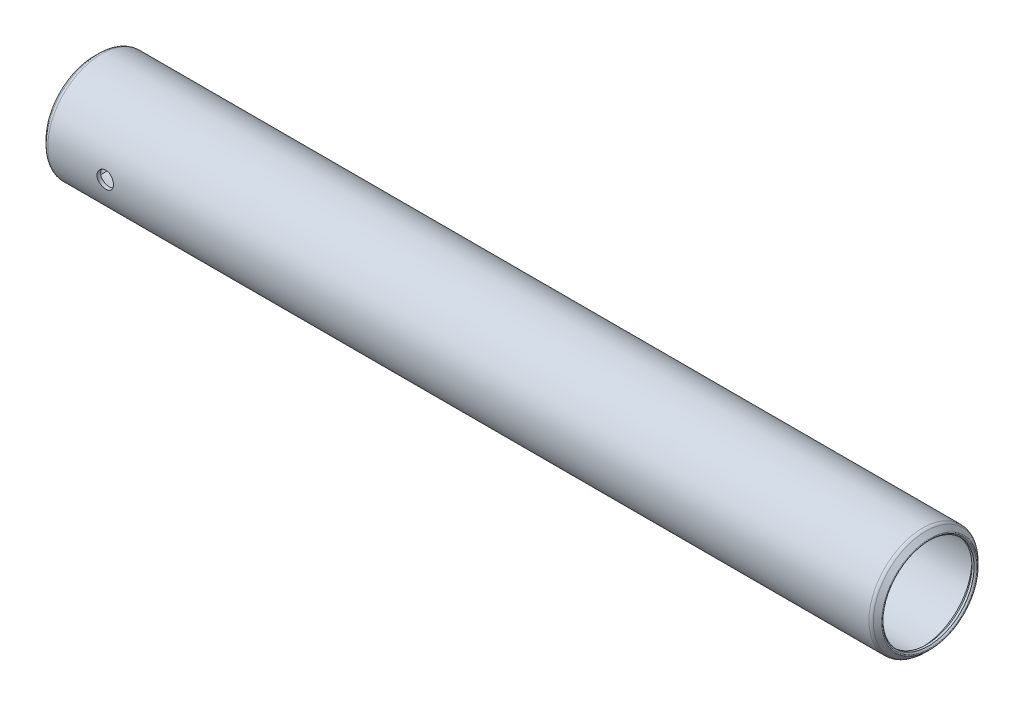
ISO-10303-21;
HEADER;
FILE_DESCRIPTION(('STEP AP214'),'2;1');
FILE_NAME('part.step','',(''),(''),'','','');
FILE_SCHEMA(('AUTOMOTIVE_DESIGN { 1 0 10303 214 1 1 1 1 }'));
ENDSEC;
DATA;
#1=APPLICATION_CONTEXT('core data for automotive mechanical design processes');
#2=APPLICATION_PROTOCOL_DEFINITION('international standard','automotive_design',2000,#1);
#3=PRODUCT_CONTEXT('',#1,'mechanical');
#4=PRODUCT('Part','Part','',(#3));
#5=PRODUCT_RELATED_PRODUCT_CATEGORY('part','',(#4));
#6=PRODUCT_DEFINITION_FORMATION('','',#4);
#7=PRODUCT_DEFINITION_CONTEXT('part definition',#1,'design');
#8=PRODUCT_DEFINITION('design','',#6,#7);
#9=PRODUCT_DEFINITION_SHAPE('','',#8);
#10=(LENGTH_UNIT() NAMED_UNIT(*) SI_UNIT(.MILLI.,.METRE.));
#11=(NAMED_UNIT(*) PLANE_ANGLE_UNIT() SI_UNIT($,.RADIAN.));
#12=(NAMED_UNIT(*) SI_UNIT($,.STERADIAN.) SOLID_ANGLE_UNIT());
#13=UNCERTAINTY_MEASURE_WITH_UNIT(LENGTH_MEASURE(1.E-05),#10,'distance_accuracy_value','');
#14=(GEOMETRIC_REPRESENTATION_CONTEXT(3) GLOBAL_UNCERTAINTY_ASSIGNED_CONTEXT((#13)) GLOBAL_UNIT_ASSIGNED_CONTEXT((#10,
#11,#12)) REPRESENTATION_CONTEXT('',''));
#15=CARTESIAN_POINT('',(0.,0.,0.));
#16=DIRECTION('',(0.,0.,1.));
#17=DIRECTION('',(1.,0.,0.));
#18=AXIS2_PLACEMENT_3D('',#15,#16,#17);
#19=CARTESIAN_POINT('',(120.5484,0.,0.));
#20=DIRECTION('',(-1.,0.,0.));
#21=DIRECTION('',(0.,0.,1.));
#22=AXIS2_PLACEMENT_3D('',#19,#20,#21);
#23=CYLINDRICAL_SURFACE('',#22,7.27075);
#24=CARTESIAN_POINT('',(0.634999999999997,0.,0.));
#25=DIRECTION('',(-1.,0.,0.));
#26=DIRECTION('',(0.,0.,1.));
#27=AXIS2_PLACEMENT_3D('',#24,#25,#26);
#28=CIRCLE('',#27,7.27075);
#29=CARTESIAN_POINT('',(0.634999999999997,0.,7.27075));
#30=VERTEX_POINT('',#29);
#31=EDGE_CURVE('E56',#30,#30,#28,.T.);
#32=ORIENTED_EDGE('',*,*,#31,.T.);
#33=EDGE_LOOP('',(#32));
#34=FACE_BOUND('',#33,.T.);
#35=CARTESIAN_POINT('',(119.9134,0.,0.));
#36=DIRECTION('',(-1.,0.,0.));
#37=DIRECTION('',(0.,0.,1.));
#38=AXIS2_PLACEMENT_3D('',#35,#36,#37);
#39=CIRCLE('',#38,7.27075);
#40=CARTESIAN_POINT('',(119.9134,0.,7.27075));
#41=VERTEX_POINT('',#40);
#42=EDGE_CURVE('E59',#41,#41,#39,.T.);
#43=ORIENTED_EDGE('',*,*,#42,.F.);
#44=EDGE_LOOP('',(#43));
#45=FACE_BOUND('',#44,.T.);
#46=CARTESIAN_POINT('',(10.0838,0.,7.27075));
#47=CARTESIAN_POINT('',(10.0837973180497,-0.0665763656223157,7.27074886912623));
#48=CARTESIAN_POINT('',(10.0782118981357,-0.133189422139325,7.26982603229932));
#49=CARTESIAN_POINT('',(10.0560265204291,-0.264548230355835,7.26623351045891));
#50=CARTESIAN_POINT('',(10.0394163416924,-0.329292191059068,7.26356220448896));
#51=CARTESIAN_POINT('',(9.99569566198161,-0.454993226185556,7.25677245539045));
#52=CARTESIAN_POINT('',(9.96859364975716,-0.51595331592106,7.25265518241654));
#53=CARTESIAN_POINT('',(9.90468063110019,-0.632452772924966,7.24342655383445));
#54=CARTESIAN_POINT('',(9.86787077172315,-0.687992779555633,7.23831531568951));
#55=CARTESIAN_POINT('',(9.78522309678459,-0.792599473441389,7.22761255264284));
#56=CARTESIAN_POINT('',(9.73931276800991,-0.8416085031718,7.22201738797767));
#57=CARTESIAN_POINT('',(9.63992345556096,-0.931264098359722,7.21100533744942));
#58=CARTESIAN_POINT('',(9.5864440012438,-0.971910143426821,7.20558846269812));
#59=CARTESIAN_POINT('',(9.47303978470973,-1.04391602816968,7.19551105091629));
#60=CARTESIAN_POINT('',(9.4130784863992,-1.07521904168257,7.19085521714684));
#61=CARTESIAN_POINT('',(9.28865966029078,-1.12728692857892,7.18287741243743));
#62=CARTESIAN_POINT('',(9.22420242734068,-1.14805249228092,7.17955535412351));
#63=CARTESIAN_POINT('',(9.09323189607469,-1.17827475743791,7.17465739869155));
#64=CARTESIAN_POINT('',(9.02674212310514,-1.18783087478537,7.17306616036318));
#65=CARTESIAN_POINT('',(8.89308526182397,-1.19567118363748,7.1717635771999));
#66=CARTESIAN_POINT('',(8.82591822035366,-1.19395614941143,7.17205210323496));
#67=CARTESIAN_POINT('',(8.69352198271034,-1.17938385727069,7.17446243892077));
#68=CARTESIAN_POINT('',(8.62828012811038,-1.16663813068547,7.17656589715222));
#69=CARTESIAN_POINT('',(8.50087366450289,-1.13054122111993,7.18234037327412));
#70=CARTESIAN_POINT('',(8.43870915827104,-1.10718968419689,7.1860114434795));
#71=CARTESIAN_POINT('',(8.31888728068215,-1.05043049008399,7.19452739942117));
#72=CARTESIAN_POINT('',(8.26125231558848,-1.01697637582203,7.19937768730761));
#73=CARTESIAN_POINT('',(8.15237176299115,-0.940994666220349,7.20970179927714));
#74=CARTESIAN_POINT('',(8.10112667680563,-0.898466359673361,7.21517567221921));
#75=CARTESIAN_POINT('',(8.00583482220782,-0.804935108121529,7.22621089146952));
#76=CARTESIAN_POINT('',(7.9618819845089,-0.753836439796722,7.23177249832445));
#77=CARTESIAN_POINT('',(7.88316045636778,-0.644939097733325,7.24229566674746));
#78=CARTESIAN_POINT('',(7.84839182191106,-0.587140383155392,7.24725722465764));
#79=CARTESIAN_POINT('',(7.78901768412653,-0.466396392315688,7.25602800690079));
#80=CARTESIAN_POINT('',(7.76442031582416,-0.403447044565726,7.25983630820479));
#81=CARTESIAN_POINT('',(7.72617325530038,-0.274234269595054,7.26586402905181));
#82=CARTESIAN_POINT('',(7.71252267456644,-0.207971111808632,7.26808357754679));
#83=CARTESIAN_POINT('',(7.69668363687801,-0.0748214486822753,7.27066641036234));
#84=CARTESIAN_POINT('',(7.69436620334303,-0.00795067683835797,7.27105058098478));
#85=CARTESIAN_POINT('',(7.7009156211892,0.125223792320965,7.26997652394854));
#86=CARTESIAN_POINT('',(7.70978205534316,0.191527510698058,7.2685183650201));
#87=CARTESIAN_POINT('',(7.73834025080113,0.321288563764816,7.26393641843455));
#88=CARTESIAN_POINT('',(7.75796831562904,0.384760293010014,7.26082243459669));
#89=CARTESIAN_POINT('',(7.80742481444332,0.507512183164864,7.25327664455669));
#90=CARTESIAN_POINT('',(7.8372538071436,0.566792114271337,7.24884476617403));
#91=CARTESIAN_POINT('',(7.90656193459883,0.680038969103148,7.23910314951883));
#92=CARTESIAN_POINT('',(7.94612182885248,0.73395583434289,7.23378619167638));
#93=CARTESIAN_POINT('',(8.03365749864083,0.834431646594976,7.22288641864574));
#94=CARTESIAN_POINT('',(8.0816338663578,0.880990075429964,7.21730358477068));
#95=CARTESIAN_POINT('',(8.1852184168714,0.965904124062182,7.20643394566787));
#96=CARTESIAN_POINT('',(8.24089837915758,1.00417270523438,7.20115067484654));
#97=CARTESIAN_POINT('',(8.3579721887638,1.07081332476845,7.19154383416012));
#98=CARTESIAN_POINT('',(8.41936585880266,1.09918567005467,7.18722023453304));
#99=CARTESIAN_POINT('',(8.54587847689332,1.14509752192922,7.18004864937368));
#100=CARTESIAN_POINT('',(8.61098121151069,1.16268073492793,7.1771947179269));
#101=CARTESIAN_POINT('',(8.74326673649393,1.18665298984634,7.17327054668051));
#102=CARTESIAN_POINT('',(8.81044935138015,1.19304297353448,7.17220015681885));
#103=CARTESIAN_POINT('',(8.94411868459628,1.19442171212747,7.17197059783136));
#104=CARTESIAN_POINT('',(9.01060399046328,1.18954744526785,7.17278846653603));
#105=CARTESIAN_POINT('',(9.14179495108415,1.16883182625237,7.17619301197557));
#106=CARTESIAN_POINT('',(9.2065006111217,1.1529905066609,7.17877968345834));
#107=CARTESIAN_POINT('',(9.33224486958994,1.11084231835238,7.1854217631554));
#108=CARTESIAN_POINT('',(9.39328739677579,1.08454690132198,7.18947556380448));
#109=CARTESIAN_POINT('',(9.51011662462723,1.02225094487892,7.19859675637365));
#110=CARTESIAN_POINT('',(9.56590307708314,0.986249947445484,7.20366419612596));
#111=CARTESIAN_POINT('',(9.67132924911467,0.905074532377647,7.21431465232543));
#112=CARTESIAN_POINT('',(9.72089077079237,0.859799232508818,7.21990293486049));
#113=CARTESIAN_POINT('',(9.81176008561317,0.761573252640159,7.23092311461084));
#114=CARTESIAN_POINT('',(9.85306596960377,0.708620802139119,7.23635497540492));
#115=CARTESIAN_POINT('',(9.92650298013843,0.596123613416147,7.24649227103988));
#116=CARTESIAN_POINT('',(9.95857094627367,0.536537183511492,7.25119260851974));
#117=CARTESIAN_POINT('',(10.0121932411223,0.412771011536573,7.25928761210429));
#118=CARTESIAN_POINT('',(10.0337581058519,0.348595946921126,7.26268358593417));
#119=CARTESIAN_POINT('',(10.0610484764275,0.236804477607541,7.26704084527022));
#120=CARTESIAN_POINT('',(10.0695667313465,0.189866582690182,7.26842438895746));
#121=CARTESIAN_POINT('',(10.0809434065434,0.0952920506420505,7.27027936357523));
#122=CARTESIAN_POINT('',(10.0838019197425,0.0476554249959267,7.27075080948051));
#123=CARTESIAN_POINT('',(10.0838,0.,7.27075));
#124=B_SPLINE_CURVE_WITH_KNOTS('',3,(#46,#47,#48,#49,#50,#51,#52,#53,#54,#55,#56,#57,#58,#59,
#60,#61,#62,#63,#64,#65,#66,#67,#68,#69,#70,#71,#72,#73,#74,#75,#76,#77,#78,#79,#80,#81,#82,#83,
#84,#85,#86,#87,#88,#89,#90,#91,#92,#93,#94,#95,#96,#97,#98,#99,#100,#101,#102,#103,#104,#105,
#106,#107,#108,#109,#110,#111,#112,#113,#114,#115,#116,#117,#118,#119,#120,#121,#122,#123),
.UNSPECIFIED.,.T.,.F.,(4,2,2,2,2,2,2,2,2,2,2,2,2,2,2,2,2,2,2,2,2,2,2,2,2,2,2,2,2,2,2,2,2,2,2,2,
2,2,4),(0.,0.199554911258924,0.399295086783101,0.598873992821056,0.798429327660285,
0.999643746073528,1.20087068135868,1.40329768224392,1.60571142022758,1.80631605458478,
2.00690690859434,2.20549297418438,2.40408566758091,2.60360587488517,2.80314172571708,
3.00507606903131,3.20701164327729,3.40910841558579,3.61118878274413,3.81096394044209,
4.01073164551581,4.20932952359342,4.40793828079643,4.60825451749828,4.80858485408871,
5.01092627175881,5.2132614134035,5.41477139553096,5.61626442233168,5.81532011940715,
6.0143752254305,6.21321287954722,6.41205991875158,6.6131972502366,6.81438104193141,
7.01690935899602,7.2192340924611,7.36207803044844,7.50491962321452),.UNSPECIFIED.);
#125=CARTESIAN_POINT('',(10.0838,0.,7.27075));
#126=VERTEX_POINT('',#125);
#127=EDGE_CURVE('E89',#126,#126,#124,.T.);
#128=ORIENTED_EDGE('',*,*,#127,.F.);
#129=EDGE_LOOP('',(#128));
#130=FACE_BOUND('',#129,.T.);
#131=ADVANCED_FACE('F32',(#34,#45,#130),#23,.F.);
#132=CARTESIAN_POINT('',(120.5484,0.,0.));
#133=DIRECTION('',(-1.,0.,0.));
#134=DIRECTION('',(0.,0.,1.));
#135=AXIS2_PLACEMENT_3D('',#132,#133,#134);
#136=CYLINDRICAL_SURFACE('',#135,7.8105);
#137=CARTESIAN_POINT('',(0.539750000000006,0.,0.));
#138=DIRECTION('',(-1.,0.,0.));
#139=DIRECTION('',(0.,0.,1.));
#140=AXIS2_PLACEMENT_3D('',#137,#138,#139);
#141=CIRCLE('',#140,7.8105);
#142=CARTESIAN_POINT('',(0.539750000000006,0.,7.8105));
#143=VERTEX_POINT('',#142);
#144=EDGE_CURVE('E80',#143,#143,#141,.T.);
#145=ORIENTED_EDGE('',*,*,#144,.F.);
#146=EDGE_LOOP('',(#145));
#147=FACE_BOUND('',#146,.T.);
#148=CARTESIAN_POINT('',(120.00865,0.,0.));
#149=DIRECTION('',(-1.,0.,0.));
#150=DIRECTION('',(0.,0.,1.));
#151=AXIS2_PLACEMENT_3D('',#148,#149,#150);
#152=CIRCLE('',#151,7.8105);
#153=CARTESIAN_POINT('',(120.00865,0.,7.8105));
#154=VERTEX_POINT('',#153);
#155=EDGE_CURVE('E77',#154,#154,#152,.T.);
#156=ORIENTED_EDGE('',*,*,#155,.T.);
#157=EDGE_LOOP('',(#156));
#158=FACE_BOUND('',#157,.T.);
#159=CARTESIAN_POINT('',(7.6962,0.,7.8105));
#160=CARTESIAN_POINT('',(7.69620273646334,-0.0666398329516414,7.81049891819337));
#161=CARTESIAN_POINT('',(7.70179875326354,-0.133317958673531,7.80963820597065));
#162=CARTESIAN_POINT('',(7.72402870307655,-0.264809416860595,7.80628749873903));
#163=CARTESIAN_POINT('',(7.74067328590999,-0.329620887085572,7.80379593176562));
#164=CARTESIAN_POINT('',(7.78449052451775,-0.45545714903395,7.79746342374147));
#165=CARTESIAN_POINT('',(7.81165511534954,-0.516484800065449,7.79362351657722));
#166=CARTESIAN_POINT('',(7.8757213223107,-0.633106599576794,7.78501829240805));
#167=CARTESIAN_POINT('',(7.91262162540386,-0.688701479379162,7.78025310021736));
#168=CARTESIAN_POINT('',(7.99543012509601,-0.793338917825563,7.77028378661992));
#169=CARTESIAN_POINT('',(8.04140162993454,-0.842331101532475,7.76507673604042));
#170=CARTESIAN_POINT('',(8.14091132939096,-0.931937728182254,7.75483341589372));
#171=CARTESIAN_POINT('',(8.19444996561411,-0.972551681845018,7.74979715631489));
#172=CARTESIAN_POINT('',(8.30791388928797,-1.04444602601217,7.74043722961758));
#173=CARTESIAN_POINT('',(8.36787051185987,-1.07567749895494,7.73611734809356));
#174=CARTESIAN_POINT('',(8.49225550746949,-1.12760768906777,7.7287193916199));
#175=CARTESIAN_POINT('',(8.55668362710899,-1.14830700253877,7.72564124636873));
#176=CARTESIAN_POINT('',(8.68765223456345,-1.17842847148577,7.72110413933663));
#177=CARTESIAN_POINT('',(8.75417242189646,-1.18793699259909,7.71963278351321));
#178=CARTESIAN_POINT('',(8.88787920779012,-1.19567455444233,7.71843824249885));
#179=CARTESIAN_POINT('',(8.95506576640224,-1.19390426729727,7.7187149531374));
#180=CARTESIAN_POINT('',(9.08758697080283,-1.17920500612085,7.72097394960283));
#181=CARTESIAN_POINT('',(9.15293258817671,-1.1663723572181,7.72294151193834));
#182=CARTESIAN_POINT('',(9.2805321334076,-1.13006349376238,7.72833750921248));
#183=CARTESIAN_POINT('',(9.34278597068418,-1.10658696757771,7.73176598692365));
#184=CARTESIAN_POINT('',(9.46272710129188,-1.04955699193537,7.73971371623396));
#185=CARTESIAN_POINT('',(9.52039475442107,-1.01596287319965,7.74423735533787));
#186=CARTESIAN_POINT('',(9.62931092071928,-0.939680275121305,7.75386255655101));
#187=CARTESIAN_POINT('',(9.68055899632882,-0.896991176398325,7.75896415800917));
#188=CARTESIAN_POINT('',(9.77573941516313,-0.803202302304859,7.76923545638721));
#189=CARTESIAN_POINT('',(9.81959020348762,-0.752019737516411,7.77440531003558));
#190=CARTESIAN_POINT('',(9.89809225721203,-0.642978628610851,7.78418140470635));
#191=CARTESIAN_POINT('',(9.93274347948591,-0.58512005319953,7.78878764308655));
#192=CARTESIAN_POINT('',(9.99186750062159,-0.464297644984686,7.79692259066929));
#193=CARTESIAN_POINT('',(10.0163338579518,-0.401330611265675,7.80045061757113));
#194=CARTESIAN_POINT('',(10.0543219566975,-0.272115525346046,7.80602596435751));
#195=CARTESIAN_POINT('',(10.0678444666427,-0.205867703884927,7.80807338821605));
#196=CARTESIAN_POINT('',(10.083452224923,-0.0726752961455404,7.81044303454276));
#197=CARTESIAN_POINT('',(10.0856495678188,-0.00574413515528593,7.81078216464642));
#198=CARTESIAN_POINT('',(10.0788423665272,0.127530731520344,7.8097430834034));
#199=CARTESIAN_POINT('',(10.0698381828088,0.193874456040439,7.80836492731958));
#200=CARTESIAN_POINT('',(10.0409767408112,0.323750561669986,7.80405658307113));
#201=CARTESIAN_POINT('',(10.021174239059,0.387295393083128,7.801134227589));
#202=CARTESIAN_POINT('',(9.97133612750317,0.510163039330169,7.79406405147403));
#203=CARTESIAN_POINT('',(9.94130002129567,0.569485649186971,7.78991617139567));
#204=CARTESIAN_POINT('',(9.87158535899785,0.682716826559532,7.78081374744967));
#205=CARTESIAN_POINT('',(9.8318358743346,0.736581246218948,7.7758533626488));
#206=CARTESIAN_POINT('',(9.74392135369307,0.836914777941201,7.76569582861299));
#207=CARTESIAN_POINT('',(9.69575580884511,0.883383442501374,7.76049866507547));
#208=CARTESIAN_POINT('',(9.59187676543193,0.968015516456356,7.75039953957522));
#209=CARTESIAN_POINT('',(9.53610163726457,1.00610368490327,7.74550051674064));
#210=CARTESIAN_POINT('',(9.41887926951428,1.0723701852063,7.73660487547725));
#211=CARTESIAN_POINT('',(9.35743218781286,1.10054879279477,7.73260823194096));
#212=CARTESIAN_POINT('',(9.23083223960826,1.14608033509009,7.72599126936372));
#213=CARTESIAN_POINT('',(9.16569375894266,1.16347251312677,7.72336596666016));
#214=CARTESIAN_POINT('',(9.03337714917995,1.18706217797389,7.7197758016584));
#215=CARTESIAN_POINT('',(8.96619916717398,1.19326047015901,7.7188108199041));
#216=CARTESIAN_POINT('',(8.83246065644958,1.19426671409332,7.71865513002324));
#217=CARTESIAN_POINT('',(8.7659010093451,1.1891929893523,7.71944599058299));
#218=CARTESIAN_POINT('',(8.63459358788535,1.16805316013447,7.7226727629834));
#219=CARTESIAN_POINT('',(8.56984581017547,1.15198707601091,7.72510867177811));
#220=CARTESIAN_POINT('',(8.44403499975099,1.10936100617533,7.7313445390143));
#221=CARTESIAN_POINT('',(8.3829689992873,1.08280960626525,7.73514338119836));
#222=CARTESIAN_POINT('',(8.2661392148611,1.01997843077836,7.74367839169512));
#223=CARTESIAN_POINT('',(8.21037562436221,0.983698300423657,7.74841459418893));
#224=CARTESIAN_POINT('',(8.1051329581918,0.902010873076255,7.75834980029298));
#225=CARTESIAN_POINT('',(8.05572221542002,0.85651603304771,7.76355295388559));
#226=CARTESIAN_POINT('',(7.96519469079388,0.757875626120004,7.77380140805301));
#227=CARTESIAN_POINT('',(7.92407983676741,0.704728285811561,7.77884667170718));
#228=CARTESIAN_POINT('',(7.85109994244319,0.591932735192255,7.78824397715299));
#229=CARTESIAN_POINT('',(7.81928922643542,0.532249036280569,7.79259188322355));
#230=CARTESIAN_POINT('',(7.7661918482117,0.408346764692882,7.80006409876217));
#231=CARTESIAN_POINT('',(7.74489435433406,0.344132937672259,7.80318966689916));
#232=CARTESIAN_POINT('',(7.71822554780552,0.233031005484256,7.80715669112726));
#233=CARTESIAN_POINT('',(7.70997868826911,0.18682655953323,7.80840395032583));
#234=CARTESIAN_POINT('',(7.69896498773605,0.0937543885835004,7.81007597992434));
#235=CARTESIAN_POINT('',(7.69619807467015,0.0468866723159289,7.81050076114106));
#236=CARTESIAN_POINT('',(7.6962,0.,7.8105));
#237=B_SPLINE_CURVE_WITH_KNOTS('',3,(#159,#160,#161,#162,#163,#164,#165,#166,#167,#168,#169,
#170,#171,#172,#173,#174,#175,#176,#177,#178,#179,#180,#181,#182,#183,#184,#185,#186,#187,#188,
#189,#190,#191,#192,#193,#194,#195,#196,#197,#198,#199,#200,#201,#202,#203,#204,#205,#206,#207,
#208,#209,#210,#211,#212,#213,#214,#215,#216,#217,#218,#219,#220,#221,#222,#223,#224,#225,#226,
#227,#228,#229,#230,#231,#232,#233,#234,#235,#236),.UNSPECIFIED.,.T.,.F.,(4,2,2,2,2,2,2,2,2,2,2,
2,2,2,2,2,2,2,2,2,2,2,2,2,2,2,2,2,2,2,2,2,2,2,2,2,2,2,4),(0.,0.19974816092799,0.39968914119229,
0.59947714338181,0.799238214321461,1.00044615223429,1.20166583716145,1.40391710936528,
1.60615692940231,1.80682549746078,2.00748210742069,2.20640895504944,2.40534162723934,
2.60508486269441,2.80484170528285,3.00667430995353,3.20850786076535,3.41046887022643,
3.6124156957815,3.81235979416098,4.01229745843626,4.21123057359261,4.41017333981954,
4.61061466461079,4.81106811310709,5.01325380238516,5.21543386542509,5.41687397158723,
5.61829958401355,5.81762081177558,6.01694167047901,6.21609965447677,6.41526490216263,
6.61641941723699,6.81762062360688,7.01997415275214,7.22211876178159,7.36266007656324,
7.50319954301023),.UNSPECIFIED.);
#238=CARTESIAN_POINT('',(7.6962,0.,7.8105));
#239=VERTEX_POINT('',#238);
#240=EDGE_CURVE('E10',#239,#239,#237,.T.);
#241=ORIENTED_EDGE('',*,*,#240,.F.);
#242=EDGE_LOOP('',(#241));
#243=FACE_BOUND('',#242,.T.);
#244=ADVANCED_FACE('F110',(#147,#158,#243),#136,.T.);
#245=CARTESIAN_POINT('',(-0.428157683632184,0.,0.));
#246=DIRECTION('',(-1.,0.,0.));
#247=DIRECTION('',(0.,0.,1.));
#248=AXIS2_PLACEMENT_3D('',#245,#246,#247);
#249=TOROIDAL_SURFACE('',#248,6.92601280605345,0.126999999999896);
#250=CARTESIAN_POINT('',(-0.517960244842769,0.,0.));
#251=DIRECTION('',(-1.,0.,0.));
#252=DIRECTION('',(0.,0.,1.));
#253=AXIS2_PLACEMENT_3D('',#250,#251,#252);
#254=CIRCLE('',#253,6.8362102448428);
#255=CARTESIAN_POINT('',(-0.517960244842769,0.,6.8362102448428));
#256=VERTEX_POINT('',#255);
#257=EDGE_CURVE('E43',#256,#256,#254,.T.);
#258=ORIENTED_EDGE('',*,*,#257,.F.);
#259=EDGE_LOOP('',(#258));
#260=FACE_BOUND('',#259,.T.);
#261=CARTESIAN_POINT('',(-0.517960244842769,0.,0.));
#262=DIRECTION('',(-1.,0.,0.));
#263=DIRECTION('',(0.,0.,1.));
#264=AXIS2_PLACEMENT_3D('',#261,#262,#263);
#265=CIRCLE('',#264,7.0158153672641);
#266=CARTESIAN_POINT('',(-0.517960244842769,0.,7.0158153672641));
#267=VERTEX_POINT('',#266);
#268=EDGE_CURVE('E86',#267,#267,#265,.T.);
#269=ORIENTED_EDGE('',*,*,#268,.T.);
#270=EDGE_LOOP('',(#269));
#271=FACE_BOUND('',#270,.T.);
#272=ADVANCED_FACE('F34',(#260,#271),#249,.T.);
#273=CARTESIAN_POINT('',(-0.517960244842769,0.,0.));
#274=DIRECTION('',(-1.,0.,0.));
#275=DIRECTION('',(0.,0.,1.));
#276=AXIS2_PLACEMENT_3D('',#273,#274,#275);
#277=CONICAL_SURFACE('',#276,6.8362102448428,0.785398163397522);
#278=CARTESIAN_POINT('',(-0.317499999999998,0.,0.));
#279=DIRECTION('',(-1.,0.,0.));
#280=DIRECTION('',(0.,0.,1.));
#281=AXIS2_PLACEMENT_3D('',#278,#279,#280);
#282=CIRCLE('',#281,6.63575);
#283=CARTESIAN_POINT('',(-0.317499999999998,0.,6.63575));
#284=VERTEX_POINT('',#283);
#285=EDGE_CURVE('E47',#284,#284,#282,.T.);
#286=ORIENTED_EDGE('',*,*,#285,.F.);
#287=EDGE_LOOP('',(#286));
#288=FACE_BOUND('',#287,.T.);
#289=ORIENTED_EDGE('',*,*,#257,.T.);
#290=EDGE_LOOP('',(#289));
#291=FACE_BOUND('',#290,.T.);
#292=ADVANCED_FACE('F159',(#288,#291),#277,.F.);
#293=CARTESIAN_POINT('',(120.5484,0.,0.));
#294=DIRECTION('',(-1.,0.,0.));
#295=DIRECTION('',(0.,0.,1.));
#296=AXIS2_PLACEMENT_3D('',#293,#294,#295);
#297=CYLINDRICAL_SURFACE('',#296,6.63575);
#298=CARTESIAN_POINT('',(0.,0.,0.));
#299=DIRECTION('',(-1.,0.,0.));
#300=DIRECTION('',(0.,0.,1.));
#301=AXIS2_PLACEMENT_3D('',#298,#299,#300);
#302=CIRCLE('',#301,6.63575);
#303=CARTESIAN_POINT('',(0.,0.,6.63575));
#304=VERTEX_POINT('',#303);
#305=EDGE_CURVE('E51',#304,#304,#302,.T.);
#306=ORIENTED_EDGE('',*,*,#305,.F.);
#307=EDGE_LOOP('',(#306));
#308=FACE_BOUND('',#307,.T.);
#309=ORIENTED_EDGE('',*,*,#285,.T.);
#310=EDGE_LOOP('',(#309));
#311=FACE_BOUND('',#310,.T.);
#312=ADVANCED_FACE('F140',(#308,#311),#297,.F.);
#313=CARTESIAN_POINT('',(0.,0.,0.));
#314=DIRECTION('',(1.,0.,0.));
#315=DIRECTION('',(0.,0.,-1.));
#316=AXIS2_PLACEMENT_3D('',#313,#314,#315);
#317=CONICAL_SURFACE('',#316,6.63575,0.78539816339745);
#318=ORIENTED_EDGE('',*,*,#31,.F.);
#319=EDGE_LOOP('',(#318));
#320=FACE_BOUND('',#319,.T.);
#321=ORIENTED_EDGE('',*,*,#305,.T.);
#322=EDGE_LOOP('',(#321));
#323=FACE_BOUND('',#322,.T.);
#324=ADVANCED_FACE('F135',(#320,#323),#317,.F.);
#325=CARTESIAN_POINT('',(119.9134,0.,0.));
#326=DIRECTION('',(-1.,0.,0.));
#327=DIRECTION('',(0.,0.,1.));
#328=AXIS2_PLACEMENT_3D('',#325,#326,#327);
#329=CONICAL_SURFACE('',#328,7.27075,0.78539816339745);
#330=CARTESIAN_POINT('',(120.5484,0.,0.));
#331=DIRECTION('',(-1.,0.,0.));
#332=DIRECTION('',(0.,0.,1.));
#333=AXIS2_PLACEMENT_3D('',#330,#331,#332);
#334=CIRCLE('',#333,6.63575);
#335=CARTESIAN_POINT('',(120.5484,0.,6.63575));
#336=VERTEX_POINT('',#335);
#337=EDGE_CURVE('E62',#336,#336,#334,.T.);
#338=ORIENTED_EDGE('',*,*,#337,.F.);
#339=EDGE_LOOP('',(#338));
#340=FACE_BOUND('',#339,.T.);
#341=ORIENTED_EDGE('',*,*,#42,.T.);
#342=EDGE_LOOP('',(#341));
#343=FACE_BOUND('',#342,.T.);
#344=ADVANCED_FACE('F132',(#340,#343),#329,.F.);
#345=CARTESIAN_POINT('',(120.5484,0.,0.));
#346=DIRECTION('',(-1.,0.,0.));
#347=DIRECTION('',(0.,0.,1.));
#348=AXIS2_PLACEMENT_3D('',#345,#346,#347);
#349=CYLINDRICAL_SURFACE('',#348,6.63575);
#350=CARTESIAN_POINT('',(120.8659,0.,0.));
#351=DIRECTION('',(-1.,0.,0.));
#352=DIRECTION('',(0.,0.,1.));
#353=AXIS2_PLACEMENT_3D('',#350,#351,#352);
#354=CIRCLE('',#353,6.63575);
#355=CARTESIAN_POINT('',(120.8659,0.,6.63575));
#356=VERTEX_POINT('',#355);
#357=EDGE_CURVE('E65',#356,#356,#354,.T.);
#358=ORIENTED_EDGE('',*,*,#357,.F.);
#359=EDGE_LOOP('',(#358));
#360=FACE_BOUND('',#359,.T.);
#361=ORIENTED_EDGE('',*,*,#337,.T.);
#362=EDGE_LOOP('',(#361));
#363=FACE_BOUND('',#362,.T.);
#364=ADVANCED_FACE('F129',(#360,#363),#349,.F.);
#365=CARTESIAN_POINT('',(120.8659,0.,0.));
#366=DIRECTION('',(1.,0.,0.));
#367=DIRECTION('',(0.,0.,-1.));
#368=AXIS2_PLACEMENT_3D('',#365,#366,#367);
#369=CONICAL_SURFACE('',#368,6.63575,0.785398163397412);
#370=CARTESIAN_POINT('',(121.066360244841,0.,0.));
#371=DIRECTION('',(-1.,0.,0.));
#372=DIRECTION('',(0.,0.,1.));
#373=AXIS2_PLACEMENT_3D('',#370,#371,#372);
#374=CIRCLE('',#373,6.8362102448414);
#375=CARTESIAN_POINT('',(121.066360244841,0.,6.8362102448414));
#376=VERTEX_POINT('',#375);
#377=EDGE_CURVE('E68',#376,#376,#374,.T.);
#378=ORIENTED_EDGE('',*,*,#377,.F.);
#379=EDGE_LOOP('',(#378));
#380=FACE_BOUND('',#379,.T.);
#381=ORIENTED_EDGE('',*,*,#357,.T.);
#382=EDGE_LOOP('',(#381));
#383=FACE_BOUND('',#382,.T.);
#384=ADVANCED_FACE('F125',(#380,#383),#369,.F.);
#385=CARTESIAN_POINT('',(120.976557683633,0.,0.));
#386=DIRECTION('',(-1.,0.,0.));
#387=DIRECTION('',(0.,0.,1.));
#388=AXIS2_PLACEMENT_3D('',#385,#386,#387);
#389=TOROIDAL_SURFACE('',#388,6.92601280605173,0.126999999998371);
#390=CARTESIAN_POINT('',(121.066360244842,0.,0.));
#391=DIRECTION('',(-1.,0.,0.));
#392=DIRECTION('',(0.,0.,1.));
#393=AXIS2_PLACEMENT_3D('',#390,#391,#392);
#394=CIRCLE('',#393,7.01581536726146);
#395=CARTESIAN_POINT('',(121.066360244842,0.,7.01581536726146));
#396=VERTEX_POINT('',#395);
#397=EDGE_CURVE('E71',#396,#396,#394,.T.);
#398=ORIENTED_EDGE('',*,*,#397,.F.);
#399=EDGE_LOOP('',(#398));
#400=FACE_BOUND('',#399,.T.);
#401=ORIENTED_EDGE('',*,*,#377,.T.);
#402=EDGE_LOOP('',(#401));
#403=FACE_BOUND('',#402,.T.);
#404=ADVANCED_FACE('F121',(#400,#403),#389,.T.);
#405=CARTESIAN_POINT('',(121.066360244842,0.,0.));
#406=DIRECTION('',(-1.,0.,0.));
#407=DIRECTION('',(0.,0.,1.));
#408=AXIS2_PLACEMENT_3D('',#405,#406,#407);
#409=CONICAL_SURFACE('',#408,7.01581536726146,0.785398163397453);
#410=CARTESIAN_POINT('',(120.457662806048,0.,0.));
#411=DIRECTION('',(-1.,0.,0.));
#412=DIRECTION('',(0.,0.,1.));
#413=AXIS2_PLACEMENT_3D('',#410,#411,#412);
#414=CIRCLE('',#413,7.6245128060557);
#415=CARTESIAN_POINT('',(120.457662806048,0.,7.6245128060557));
#416=VERTEX_POINT('',#415);
#417=EDGE_CURVE('E74',#416,#416,#414,.T.);
#418=ORIENTED_EDGE('',*,*,#417,.F.);
#419=EDGE_LOOP('',(#418));
#420=FACE_BOUND('',#419,.T.);
#421=ORIENTED_EDGE('',*,*,#397,.T.);
#422=EDGE_LOOP('',(#421));
#423=FACE_BOUND('',#422,.T.);
#424=ADVANCED_FACE('F117',(#420,#423),#409,.T.);
#425=CARTESIAN_POINT('',(120.00865,0.,0.));
#426=DIRECTION('',(-1.,0.,0.));
#427=DIRECTION('',(0.,0.,1.));
#428=AXIS2_PLACEMENT_3D('',#425,#426,#427);
#429=TOROIDAL_SURFACE('',#428,7.17550000000773,0.634999999992256);
#430=ORIENTED_EDGE('',*,*,#155,.F.);
#431=EDGE_LOOP('',(#430));
#432=FACE_BOUND('',#431,.T.);
#433=ORIENTED_EDGE('',*,*,#417,.T.);
#434=EDGE_LOOP('',(#433));
#435=FACE_BOUND('',#434,.T.);
#436=ADVANCED_FACE('F108',(#432,#435),#429,.T.);
#437=CARTESIAN_POINT('',(0.539749999999892,0.,0.));
#438=DIRECTION('',(-1.,0.,0.));
#439=DIRECTION('',(0.,0.,1.));
#440=AXIS2_PLACEMENT_3D('',#437,#438,#439);
#441=TOROIDAL_SURFACE('',#440,7.17550000000016,0.634999999999845);
#442=CARTESIAN_POINT('',(0.0907371939465468,0.,0.));
#443=DIRECTION('',(-1.,0.,0.));
#444=DIRECTION('',(0.,0.,1.));
#445=AXIS2_PLACEMENT_3D('',#442,#443,#444);
#446=CIRCLE('',#445,7.6245128060535);
#447=CARTESIAN_POINT('',(0.0907371939465468,0.,7.6245128060535));
#448=VERTEX_POINT('',#447);
#449=EDGE_CURVE('E83',#448,#448,#446,.T.);
#450=ORIENTED_EDGE('',*,*,#449,.F.);
#451=EDGE_LOOP('',(#450));
#452=FACE_BOUND('',#451,.T.);
#453=ORIENTED_EDGE('',*,*,#144,.T.);
#454=EDGE_LOOP('',(#453));
#455=FACE_BOUND('',#454,.T.);
#456=ADVANCED_FACE('F105',(#452,#455),#441,.T.);
#457=CARTESIAN_POINT('',(0.0907371939465468,0.,0.));
#458=DIRECTION('',(1.,0.,0.));
#459=DIRECTION('',(0.,0.,-1.));
#460=AXIS2_PLACEMENT_3D('',#457,#458,#459);
#461=CONICAL_SURFACE('',#460,7.6245128060535,0.785398163397517);
#462=ORIENTED_EDGE('',*,*,#268,.F.);
#463=EDGE_LOOP('',(#462));
#464=FACE_BOUND('',#463,.T.);
#465=ORIENTED_EDGE('',*,*,#449,.T.);
#466=EDGE_LOOP('',(#465));
#467=FACE_BOUND('',#466,.T.);
#468=ADVANCED_FACE('F101',(#464,#467),#461,.T.);
#469=CARTESIAN_POINT('',(8.89,0.,7.8105));
#470=DIRECTION('',(0.,0.,-1.));
#471=DIRECTION('',(-1.,0.,0.));
#472=AXIS2_PLACEMENT_3D('',#469,#470,#471);
#473=CYLINDRICAL_SURFACE('',#472,1.1938);
#474=ORIENTED_EDGE('',*,*,#240,.T.);
#475=EDGE_LOOP('',(#474));
#476=FACE_BOUND('',#475,.T.);
#477=ORIENTED_EDGE('',*,*,#127,.T.);
#478=EDGE_LOOP('',(#477));
#479=FACE_BOUND('',#478,.T.);
#480=ADVANCED_FACE('F97',(#476,#479),#473,.F.);
#481=CLOSED_SHELL('',(#131,#244,#272,#292,#312,#324,#344,#364,#384,#404,#424,#436,#456,#468,#480));
#482=MANIFOLD_SOLID_BREP('B2',#481);
#483=ADVANCED_BREP_SHAPE_REPRESENTATION('',(#18,#482),#14);
#484=SHAPE_DEFINITION_REPRESENTATION(#9,#483);
ENDSEC;
END-ISO-10303-21;
